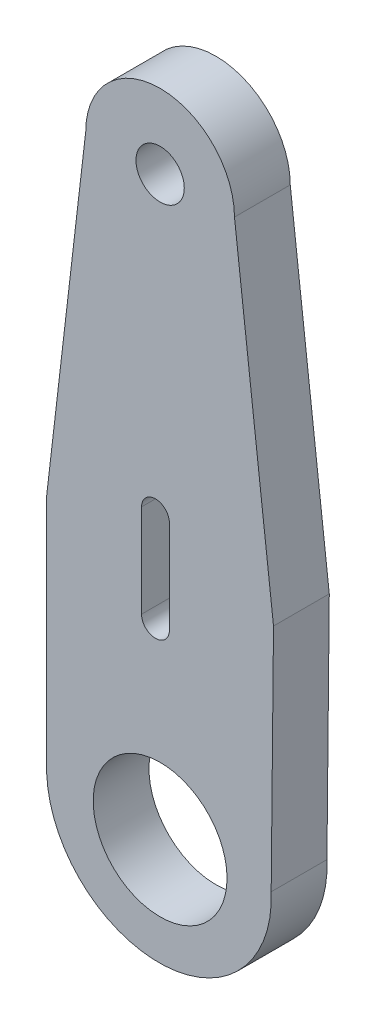
ISO-10303-21;
HEADER;
FILE_DESCRIPTION(('STEP AP214'),'2;1');
FILE_NAME('part.step','',(''),(''),'','','');
FILE_SCHEMA(('AUTOMOTIVE_DESIGN { 1 0 10303 214 1 1 1 1 }'));
ENDSEC;
DATA;
#1=APPLICATION_CONTEXT('core data for automotive mechanical design processes');
#2=APPLICATION_PROTOCOL_DEFINITION('international standard','automotive_design',2000,#1);
#3=PRODUCT_CONTEXT('',#1,'mechanical');
#4=PRODUCT('Part','Part','',(#3));
#5=PRODUCT_RELATED_PRODUCT_CATEGORY('part','',(#4));
#6=PRODUCT_DEFINITION_FORMATION('','',#4);
#7=PRODUCT_DEFINITION_CONTEXT('part definition',#1,'design');
#8=PRODUCT_DEFINITION('design','',#6,#7);
#9=PRODUCT_DEFINITION_SHAPE('','',#8);
#10=(LENGTH_UNIT() NAMED_UNIT(*) SI_UNIT(.MILLI.,.METRE.));
#11=(NAMED_UNIT(*) PLANE_ANGLE_UNIT() SI_UNIT($,.RADIAN.));
#12=(NAMED_UNIT(*) SI_UNIT($,.STERADIAN.) SOLID_ANGLE_UNIT());
#13=UNCERTAINTY_MEASURE_WITH_UNIT(LENGTH_MEASURE(1.E-05),#10,'distance_accuracy_value','');
#14=(GEOMETRIC_REPRESENTATION_CONTEXT(3) GLOBAL_UNCERTAINTY_ASSIGNED_CONTEXT((#13)) GLOBAL_UNIT_ASSIGNED_CONTEXT((#10,
#11,#12)) REPRESENTATION_CONTEXT('',''));
#15=CARTESIAN_POINT('',(0.,0.,0.));
#16=DIRECTION('',(0.,0.,1.));
#17=DIRECTION('',(1.,0.,0.));
#18=AXIS2_PLACEMENT_3D('',#15,#16,#17);
#19=CARTESIAN_POINT('',(60.5000000000001,56.3248766172572,3.));
#20=DIRECTION('',(0.,0.,1.));
#21=DIRECTION('',(1.,0.,0.));
#22=AXIS2_PLACEMENT_3D('',#19,#20,#21);
#23=PLANE('',#22);
#24=CARTESIAN_POINT('',(60.5000000000001,56.3248766172572,3.));
#25=DIRECTION('',(0.,0.,1.));
#26=DIRECTION('',(1.,0.,0.));
#27=AXIS2_PLACEMENT_3D('',#24,#25,#26);
#28=CIRCLE('',#27,1.3);
#29=CARTESIAN_POINT('',(61.8000000000001,56.3248766172572,3.));
#30=VERTEX_POINT('',#29);
#31=EDGE_CURVE('E154',#30,#30,#28,.T.);
#32=ORIENTED_EDGE('',*,*,#31,.F.);
#33=EDGE_LOOP('',(#32));
#34=FACE_BOUND('',#33,.T.);
#35=CARTESIAN_POINT('',(60.5000000000001,56.3248766172572,3.));
#36=DIRECTION('',(0.,0.,1.));
#37=DIRECTION('',(1.,0.,0.));
#38=AXIS2_PLACEMENT_3D('',#35,#36,#37);
#39=CIRCLE('',#38,4.00000000000051);
#40=CARTESIAN_POINT('',(64.5000000000006,56.324876617257,3.));
#41=VERTEX_POINT('',#40);
#42=CARTESIAN_POINT('',(56.4999999999995,56.3248766172572,3.));
#43=VERTEX_POINT('',#42);
#44=EDGE_CURVE('E160',#41,#43,#39,.T.);
#45=ORIENTED_EDGE('',*,*,#44,.T.);
#46=DIRECTION('',(-0.115881324440659,-0.993263066184321,0.));
#47=VECTOR('',#46,1.);
#48=CARTESIAN_POINT('',(56.4999999999995,56.3248766172572,3.));
#49=LINE('',#48,#47);
#50=CARTESIAN_POINT('',(54.4000000000001,38.3249750019231,3.));
#51=VERTEX_POINT('',#50);
#52=EDGE_CURVE('E163',#43,#51,#49,.T.);
#53=ORIENTED_EDGE('',*,*,#52,.T.);
#54=DIRECTION('',(0.,-1.,0.));
#55=VECTOR('',#54,1.);
#56=CARTESIAN_POINT('',(54.4000000000001,32.3249750019231,3.));
#57=LINE('',#56,#55);
#58=CARTESIAN_POINT('',(54.4000000000001,25.3249750019231,3.));
#59=VERTEX_POINT('',#58);
#60=EDGE_CURVE('E166',#51,#59,#57,.T.);
#61=ORIENTED_EDGE('',*,*,#60,.T.);
#62=CARTESIAN_POINT('',(60.4371809123243,25.6020561095563,3.));
#63=DIRECTION('',(0.,0.,1.));
#64=DIRECTION('',(1.,0.,0.));
#65=AXIS2_PLACEMENT_3D('',#62,#63,#64);
#66=CIRCLE('',#65,6.0435359937986);
#67=CARTESIAN_POINT('',(66.4743618246486,25.8791372171896,3.));
#68=VERTEX_POINT('',#67);
#69=EDGE_CURVE('E168',#59,#68,#66,.T.);
#70=ORIENTED_EDGE('',*,*,#69,.T.);
#71=DIRECTION('',(0.0100942802278319,0.999949051455464,0.));
#72=VECTOR('',#71,1.);
#73=CARTESIAN_POINT('',(66.6,38.3249750019231,3.));
#74=LINE('',#73,#72);
#75=CARTESIAN_POINT('',(66.6,38.3249750019231,3.));
#76=VERTEX_POINT('',#75);
#77=EDGE_CURVE('E170',#68,#76,#74,.T.);
#78=ORIENTED_EDGE('',*,*,#77,.T.);
#79=DIRECTION('',(-0.11588132444066,0.993263066184321,0.));
#80=VECTOR('',#79,1.);
#81=CARTESIAN_POINT('',(64.5000000000006,56.324876617257,3.));
#82=LINE('',#81,#80);
#83=EDGE_CURVE('E172',#76,#41,#82,.T.);
#84=ORIENTED_EDGE('',*,*,#83,.T.);
#85=EDGE_LOOP('',(#45,#53,#61,#70,#78,#84));
#86=FACE_BOUND('',#85,.T.);
#87=CARTESIAN_POINT('',(60.5000500000001,25.3249847224198,3.));
#88=DIRECTION('',(0.,0.,1.));
#89=DIRECTION('',(1.,0.,0.));
#90=AXIS2_PLACEMENT_3D('',#87,#88,#89);
#91=CIRCLE('',#90,3.6);
#92=CARTESIAN_POINT('',(64.1000500000001,25.3249847224198,3.));
#93=VERTEX_POINT('',#92);
#94=EDGE_CURVE('E148',#93,#93,#91,.T.);
#95=ORIENTED_EDGE('',*,*,#94,.F.);
#96=EDGE_LOOP('',(#95));
#97=FACE_BOUND('',#96,.T.);
#98=DIRECTION('',(0.,-1.,0.));
#99=VECTOR('',#98,1.);
#100=CARTESIAN_POINT('',(59.5000000000003,35.32493472242,3.));
#101=LINE('',#100,#99);
#102=CARTESIAN_POINT('',(59.5000000000005,40.3249347224198,3.));
#103=VERTEX_POINT('',#102);
#104=CARTESIAN_POINT('',(59.5000000000003,35.32493472242,3.));
#105=VERTEX_POINT('',#104);
#106=EDGE_CURVE('E120',#103,#105,#101,.T.);
#107=ORIENTED_EDGE('',*,*,#106,.F.);
#108=CARTESIAN_POINT('',(60.2500000000003,40.3249347224198,3.));
#109=DIRECTION('',(0.,0.,1.));
#110=DIRECTION('',(-1.,0.,0.));
#111=AXIS2_PLACEMENT_3D('',#108,#109,#110);
#112=CIRCLE('',#111,0.749999999999886);
#113=CARTESIAN_POINT('',(61.0000000000003,40.3249347224198,3.));
#114=VERTEX_POINT('',#113);
#115=EDGE_CURVE('E112',#114,#103,#112,.T.);
#116=ORIENTED_EDGE('',*,*,#115,.F.);
#117=DIRECTION('',(0.,1.,0.));
#118=VECTOR('',#117,1.);
#119=CARTESIAN_POINT('',(61.0000000000003,40.3249347224198,3.));
#120=LINE('',#119,#118);
#121=CARTESIAN_POINT('',(61.0000000000003,35.32493472242,3.));
#122=VERTEX_POINT('',#121);
#123=EDGE_CURVE('E134',#122,#114,#120,.T.);
#124=ORIENTED_EDGE('',*,*,#123,.F.);
#125=CARTESIAN_POINT('',(60.2500000000003,35.32493472242,3.));
#126=DIRECTION('',(0.,0.,1.));
#127=DIRECTION('',(1.,0.,0.));
#128=AXIS2_PLACEMENT_3D('',#125,#126,#127);
#129=CIRCLE('',#128,0.750000000000001);
#130=EDGE_CURVE('E132',#105,#122,#129,.T.);
#131=ORIENTED_EDGE('',*,*,#130,.F.);
#132=EDGE_LOOP('',(#107,#116,#124,#131));
#133=FACE_BOUND('',#132,.T.);
#134=ADVANCED_FACE('F35',(#34,#86,#97,#133),#23,.T.);
#135=CARTESIAN_POINT('',(60.5000000000001,56.3248766172572,0.));
#136=DIRECTION('',(0.,0.,1.));
#137=DIRECTION('',(1.,0.,0.));
#138=AXIS2_PLACEMENT_3D('',#135,#136,#137);
#139=PLANE('',#138);
#140=CARTESIAN_POINT('',(60.5000500000001,25.3249847224198,0.));
#141=DIRECTION('',(0.,0.,1.));
#142=DIRECTION('',(1.,0.,0.));
#143=AXIS2_PLACEMENT_3D('',#140,#141,#142);
#144=CIRCLE('',#143,3.6);
#145=CARTESIAN_POINT('',(64.1000500000001,25.3249847224198,0.));
#146=VERTEX_POINT('',#145);
#147=EDGE_CURVE('E128',#146,#146,#144,.T.);
#148=ORIENTED_EDGE('',*,*,#147,.T.);
#149=EDGE_LOOP('',(#148));
#150=FACE_BOUND('',#149,.T.);
#151=CARTESIAN_POINT('',(60.5000000000001,56.3248766172572,0.));
#152=DIRECTION('',(0.,0.,1.));
#153=DIRECTION('',(1.,0.,0.));
#154=AXIS2_PLACEMENT_3D('',#151,#152,#153);
#155=CIRCLE('',#154,1.3);
#156=CARTESIAN_POINT('',(61.8000000000001,56.3248766172572,0.));
#157=VERTEX_POINT('',#156);
#158=EDGE_CURVE('E151',#157,#157,#155,.T.);
#159=ORIENTED_EDGE('',*,*,#158,.T.);
#160=EDGE_LOOP('',(#159));
#161=FACE_BOUND('',#160,.T.);
#162=CARTESIAN_POINT('',(60.5000000000001,56.3248766172572,0.));
#163=DIRECTION('',(0.,0.,1.));
#164=DIRECTION('',(1.,0.,0.));
#165=AXIS2_PLACEMENT_3D('',#162,#163,#164);
#166=CIRCLE('',#165,4.00000000000051);
#167=CARTESIAN_POINT('',(64.5000000000006,56.324876617257,0.));
#168=VERTEX_POINT('',#167);
#169=CARTESIAN_POINT('',(56.4999999999995,56.3248766172572,0.));
#170=VERTEX_POINT('',#169);
#171=EDGE_CURVE('E157',#168,#170,#166,.T.);
#172=ORIENTED_EDGE('',*,*,#171,.F.);
#173=DIRECTION('',(-0.11588132444066,0.993263066184321,0.));
#174=VECTOR('',#173,1.);
#175=CARTESIAN_POINT('',(64.5000000000006,56.324876617257,0.));
#176=LINE('',#175,#174);
#177=CARTESIAN_POINT('',(66.6,38.3249750019231,0.));
#178=VERTEX_POINT('',#177);
#179=EDGE_CURVE('E164',#178,#168,#176,.T.);
#180=ORIENTED_EDGE('',*,*,#179,.F.);
#181=DIRECTION('',(0.0100942802278319,0.999949051455464,0.));
#182=VECTOR('',#181,1.);
#183=CARTESIAN_POINT('',(66.6,38.3249750019231,0.));
#184=LINE('',#183,#182);
#185=CARTESIAN_POINT('',(66.4743618246486,25.8791372171896,0.));
#186=VERTEX_POINT('',#185);
#187=EDGE_CURVE('E184',#186,#178,#184,.T.);
#188=ORIENTED_EDGE('',*,*,#187,.F.);
#189=CARTESIAN_POINT('',(60.4371809123243,25.6020561095563,0.));
#190=DIRECTION('',(0.,0.,1.));
#191=DIRECTION('',(1.,0.,0.));
#192=AXIS2_PLACEMENT_3D('',#189,#190,#191);
#193=CIRCLE('',#192,6.0435359937986);
#194=CARTESIAN_POINT('',(54.4000000000001,25.3249750019231,0.));
#195=VERTEX_POINT('',#194);
#196=EDGE_CURVE('E182',#195,#186,#193,.T.);
#197=ORIENTED_EDGE('',*,*,#196,.F.);
#198=DIRECTION('',(0.,-1.,0.));
#199=VECTOR('',#198,1.);
#200=CARTESIAN_POINT('',(54.4000000000001,32.3249750019231,0.));
#201=LINE('',#200,#199);
#202=CARTESIAN_POINT('',(54.4000000000001,38.3249750019231,0.));
#203=VERTEX_POINT('',#202);
#204=EDGE_CURVE('E180',#203,#195,#201,.T.);
#205=ORIENTED_EDGE('',*,*,#204,.F.);
#206=DIRECTION('',(-0.115881324440659,-0.993263066184321,0.));
#207=VECTOR('',#206,1.);
#208=CARTESIAN_POINT('',(56.4999999999995,56.3248766172572,0.));
#209=LINE('',#208,#207);
#210=EDGE_CURVE('E177',#170,#203,#209,.T.);
#211=ORIENTED_EDGE('',*,*,#210,.F.);
#212=EDGE_LOOP('',(#172,#180,#188,#197,#205,#211));
#213=FACE_BOUND('',#212,.T.);
#214=CARTESIAN_POINT('',(60.2500000000003,40.3249347224198,0.));
#215=DIRECTION('',(0.,0.,1.));
#216=DIRECTION('',(-1.,0.,0.));
#217=AXIS2_PLACEMENT_3D('',#214,#215,#216);
#218=CIRCLE('',#217,0.749999999999886);
#219=CARTESIAN_POINT('',(61.0000000000003,40.3249347224198,0.));
#220=VERTEX_POINT('',#219);
#221=CARTESIAN_POINT('',(59.5000000000005,40.3249347224198,0.));
#222=VERTEX_POINT('',#221);
#223=EDGE_CURVE('E58',#220,#222,#218,.T.);
#224=ORIENTED_EDGE('',*,*,#223,.T.);
#225=DIRECTION('',(0.,-1.,0.));
#226=VECTOR('',#225,1.);
#227=CARTESIAN_POINT('',(59.5000000000003,35.32493472242,0.));
#228=LINE('',#227,#226);
#229=CARTESIAN_POINT('',(59.5000000000003,35.32493472242,0.));
#230=VERTEX_POINT('',#229);
#231=EDGE_CURVE('E127',#222,#230,#228,.T.);
#232=ORIENTED_EDGE('',*,*,#231,.T.);
#233=CARTESIAN_POINT('',(60.2500000000003,35.32493472242,0.));
#234=DIRECTION('',(0.,0.,1.));
#235=DIRECTION('',(1.,0.,0.));
#236=AXIS2_PLACEMENT_3D('',#233,#234,#235);
#237=CIRCLE('',#236,0.750000000000001);
#238=CARTESIAN_POINT('',(61.0000000000003,35.32493472242,0.));
#239=VERTEX_POINT('',#238);
#240=EDGE_CURVE('E140',#230,#239,#237,.T.);
#241=ORIENTED_EDGE('',*,*,#240,.T.);
#242=DIRECTION('',(0.,1.,0.));
#243=VECTOR('',#242,1.);
#244=CARTESIAN_POINT('',(61.0000000000003,40.3249347224198,0.));
#245=LINE('',#244,#243);
#246=EDGE_CURVE('E121',#239,#220,#245,.T.);
#247=ORIENTED_EDGE('',*,*,#246,.T.);
#248=EDGE_LOOP('',(#224,#232,#241,#247));
#249=FACE_BOUND('',#248,.T.);
#250=ADVANCED_FACE('F208',(#150,#161,#213,#249),#139,.F.);
#251=CARTESIAN_POINT('',(60.5000000000001,56.3248766172572,3.));
#252=DIRECTION('',(0.,0.,-1.));
#253=DIRECTION('',(-1.,0.,0.));
#254=AXIS2_PLACEMENT_3D('',#251,#252,#253);
#255=CYLINDRICAL_SURFACE('',#254,4.00000000000051);
#256=ORIENTED_EDGE('',*,*,#171,.T.);
#257=DIRECTION('',(0.,0.,-1.));
#258=VECTOR('',#257,1.);
#259=CARTESIAN_POINT('',(56.4999999999995,56.3248766172572,3.));
#260=LINE('',#259,#258);
#261=EDGE_CURVE('E11',#43,#170,#260,.T.);
#262=ORIENTED_EDGE('',*,*,#261,.F.);
#263=ORIENTED_EDGE('',*,*,#44,.F.);
#264=DIRECTION('',(0.,0.,-1.));
#265=VECTOR('',#264,1.);
#266=CARTESIAN_POINT('',(64.5000000000006,56.324876617257,3.));
#267=LINE('',#266,#265);
#268=EDGE_CURVE('E174',#41,#168,#267,.T.);
#269=ORIENTED_EDGE('',*,*,#268,.T.);
#270=EDGE_LOOP('',(#256,#262,#263,#269));
#271=FACE_BOUND('',#270,.T.);
#272=ADVANCED_FACE('F37',(#271),#255,.T.);
#273=CARTESIAN_POINT('',(56.4999999999995,56.3248766172572,3.));
#274=DIRECTION('',(0.993263066184321,-0.115881324440659,0.));
#275=DIRECTION('',(0.115881324440659,0.993263066184321,0.));
#276=AXIS2_PLACEMENT_3D('',#273,#274,#275);
#277=PLANE('',#276);
#278=ORIENTED_EDGE('',*,*,#210,.T.);
#279=DIRECTION('',(0.,0.,-1.));
#280=VECTOR('',#279,1.);
#281=CARTESIAN_POINT('',(54.4000000000001,38.3249750019231,3.));
#282=LINE('',#281,#280);
#283=EDGE_CURVE('E43',#51,#203,#282,.T.);
#284=ORIENTED_EDGE('',*,*,#283,.F.);
#285=ORIENTED_EDGE('',*,*,#52,.F.);
#286=ORIENTED_EDGE('',*,*,#261,.T.);
#287=EDGE_LOOP('',(#278,#284,#285,#286));
#288=FACE_BOUND('',#287,.T.);
#289=ADVANCED_FACE('F204',(#288),#277,.F.);
#290=CARTESIAN_POINT('',(54.4000000000001,32.3249750019231,3.));
#291=DIRECTION('',(1.,0.,0.));
#292=DIRECTION('',(0.,0.,-1.));
#293=AXIS2_PLACEMENT_3D('',#290,#291,#292);
#294=PLANE('',#293);
#295=ORIENTED_EDGE('',*,*,#204,.T.);
#296=DIRECTION('',(0.,0.,-1.));
#297=VECTOR('',#296,1.);
#298=CARTESIAN_POINT('',(54.4000000000001,25.3249750019231,3.));
#299=LINE('',#298,#297);
#300=EDGE_CURVE('E195',#59,#195,#299,.T.);
#301=ORIENTED_EDGE('',*,*,#300,.F.);
#302=ORIENTED_EDGE('',*,*,#60,.F.);
#303=ORIENTED_EDGE('',*,*,#283,.T.);
#304=EDGE_LOOP('',(#295,#301,#302,#303));
#305=FACE_BOUND('',#304,.T.);
#306=ADVANCED_FACE('F201',(#305),#294,.F.);
#307=CARTESIAN_POINT('',(60.4371809123243,25.6020561095563,3.));
#308=DIRECTION('',(0.,0.,-1.));
#309=DIRECTION('',(-1.,0.,0.));
#310=AXIS2_PLACEMENT_3D('',#307,#308,#309);
#311=CYLINDRICAL_SURFACE('',#310,6.0435359937986);
#312=ORIENTED_EDGE('',*,*,#196,.T.);
#313=DIRECTION('',(0.,0.,-1.));
#314=VECTOR('',#313,1.);
#315=CARTESIAN_POINT('',(66.4743618246486,25.8791372171896,3.));
#316=LINE('',#315,#314);
#317=EDGE_CURVE('E192',#68,#186,#316,.T.);
#318=ORIENTED_EDGE('',*,*,#317,.F.);
#319=ORIENTED_EDGE('',*,*,#69,.F.);
#320=ORIENTED_EDGE('',*,*,#300,.T.);
#321=EDGE_LOOP('',(#312,#318,#319,#320));
#322=FACE_BOUND('',#321,.T.);
#323=ADVANCED_FACE('F215',(#322),#311,.T.);
#324=CARTESIAN_POINT('',(66.6,38.3249750019231,3.));
#325=DIRECTION('',(-0.999949051455464,0.0100942802278319,0.));
#326=DIRECTION('',(-0.0100942802278319,-0.999949051455464,0.));
#327=AXIS2_PLACEMENT_3D('',#324,#325,#326);
#328=PLANE('',#327);
#329=ORIENTED_EDGE('',*,*,#187,.T.);
#330=DIRECTION('',(0.,0.,-1.));
#331=VECTOR('',#330,1.);
#332=CARTESIAN_POINT('',(66.6,38.3249750019231,3.));
#333=LINE('',#332,#331);
#334=EDGE_CURVE('E189',#76,#178,#333,.T.);
#335=ORIENTED_EDGE('',*,*,#334,.F.);
#336=ORIENTED_EDGE('',*,*,#77,.F.);
#337=ORIENTED_EDGE('',*,*,#317,.T.);
#338=EDGE_LOOP('',(#329,#335,#336,#337));
#339=FACE_BOUND('',#338,.T.);
#340=ADVANCED_FACE('F219',(#339),#328,.F.);
#341=CARTESIAN_POINT('',(64.5000000000006,56.324876617257,3.));
#342=DIRECTION('',(-0.993263066184321,-0.11588132444066,0.));
#343=DIRECTION('',(0.11588132444066,-0.993263066184321,0.));
#344=AXIS2_PLACEMENT_3D('',#341,#342,#343);
#345=PLANE('',#344);
#346=ORIENTED_EDGE('',*,*,#179,.T.);
#347=ORIENTED_EDGE('',*,*,#268,.F.);
#348=ORIENTED_EDGE('',*,*,#83,.F.);
#349=ORIENTED_EDGE('',*,*,#334,.T.);
#350=EDGE_LOOP('',(#346,#347,#348,#349));
#351=FACE_BOUND('',#350,.T.);
#352=ADVANCED_FACE('F228',(#351),#345,.F.);
#353=CARTESIAN_POINT('',(60.5000000000001,56.3248766172572,3.));
#354=DIRECTION('',(0.,0.,-1.));
#355=DIRECTION('',(-1.,0.,0.));
#356=AXIS2_PLACEMENT_3D('',#353,#354,#355);
#357=CYLINDRICAL_SURFACE('',#356,1.3);
#358=ORIENTED_EDGE('',*,*,#31,.T.);
#359=EDGE_LOOP('',(#358));
#360=FACE_BOUND('',#359,.T.);
#361=ORIENTED_EDGE('',*,*,#158,.F.);
#362=EDGE_LOOP('',(#361));
#363=FACE_BOUND('',#362,.T.);
#364=ADVANCED_FACE('F230',(#360,#363),#357,.F.);
#365=CARTESIAN_POINT('',(60.5000500000001,25.3249847224198,3.));
#366=DIRECTION('',(0.,0.,-1.));
#367=DIRECTION('',(-1.,0.,0.));
#368=AXIS2_PLACEMENT_3D('',#365,#366,#367);
#369=CYLINDRICAL_SURFACE('',#368,3.6);
#370=ORIENTED_EDGE('',*,*,#94,.T.);
#371=EDGE_LOOP('',(#370));
#372=FACE_BOUND('',#371,.T.);
#373=ORIENTED_EDGE('',*,*,#147,.F.);
#374=EDGE_LOOP('',(#373));
#375=FACE_BOUND('',#374,.T.);
#376=ADVANCED_FACE('F236',(#372,#375),#369,.F.);
#377=CARTESIAN_POINT('',(60.2500000000003,40.3249347224198,3.));
#378=DIRECTION('',(0.,0.,-1.));
#379=DIRECTION('',(-1.,0.,0.));
#380=AXIS2_PLACEMENT_3D('',#377,#378,#379);
#381=CYLINDRICAL_SURFACE('',#380,0.749999999999886);
#382=ORIENTED_EDGE('',*,*,#223,.F.);
#383=DIRECTION('',(0.,0.,-1.));
#384=VECTOR('',#383,1.);
#385=CARTESIAN_POINT('',(61.0000000000003,40.3249347224198,3.));
#386=LINE('',#385,#384);
#387=EDGE_CURVE('E116',#114,#220,#386,.T.);
#388=ORIENTED_EDGE('',*,*,#387,.F.);
#389=ORIENTED_EDGE('',*,*,#115,.T.);
#390=DIRECTION('',(0.,0.,-1.));
#391=VECTOR('',#390,1.);
#392=CARTESIAN_POINT('',(59.5000000000005,40.3249347224198,3.));
#393=LINE('',#392,#391);
#394=EDGE_CURVE('E115',#103,#222,#393,.T.);
#395=ORIENTED_EDGE('',*,*,#394,.T.);
#396=EDGE_LOOP('',(#382,#388,#389,#395));
#397=FACE_BOUND('',#396,.T.);
#398=ADVANCED_FACE('F114',(#397),#381,.F.);
#399=CARTESIAN_POINT('',(59.5000000000003,35.32493472242,3.));
#400=DIRECTION('',(1.,0.,0.));
#401=DIRECTION('',(0.,1.,0.));
#402=AXIS2_PLACEMENT_3D('',#399,#400,#401);
#403=PLANE('',#402);
#404=ORIENTED_EDGE('',*,*,#231,.F.);
#405=ORIENTED_EDGE('',*,*,#394,.F.);
#406=ORIENTED_EDGE('',*,*,#106,.T.);
#407=DIRECTION('',(0.,0.,-1.));
#408=VECTOR('',#407,1.);
#409=CARTESIAN_POINT('',(59.5000000000003,35.32493472242,3.));
#410=LINE('',#409,#408);
#411=EDGE_CURVE('E129',#105,#230,#410,.T.);
#412=ORIENTED_EDGE('',*,*,#411,.T.);
#413=EDGE_LOOP('',(#404,#405,#406,#412));
#414=FACE_BOUND('',#413,.T.);
#415=ADVANCED_FACE('F124',(#414),#403,.T.);
#416=CARTESIAN_POINT('',(60.2500000000003,35.32493472242,3.));
#417=DIRECTION('',(0.,0.,-1.));
#418=DIRECTION('',(-1.,0.,0.));
#419=AXIS2_PLACEMENT_3D('',#416,#417,#418);
#420=CYLINDRICAL_SURFACE('',#419,0.750000000000001);
#421=ORIENTED_EDGE('',*,*,#240,.F.);
#422=ORIENTED_EDGE('',*,*,#411,.F.);
#423=ORIENTED_EDGE('',*,*,#130,.T.);
#424=DIRECTION('',(0.,0.,-1.));
#425=VECTOR('',#424,1.);
#426=CARTESIAN_POINT('',(61.0000000000003,35.32493472242,3.));
#427=LINE('',#426,#425);
#428=EDGE_CURVE('E50',#122,#239,#427,.T.);
#429=ORIENTED_EDGE('',*,*,#428,.T.);
#430=EDGE_LOOP('',(#421,#422,#423,#429));
#431=FACE_BOUND('',#430,.T.);
#432=ADVANCED_FACE('F257',(#431),#420,.F.);
#433=CARTESIAN_POINT('',(61.0000000000003,40.3249347224198,3.));
#434=DIRECTION('',(-1.,0.,0.));
#435=DIRECTION('',(0.,-1.,0.));
#436=AXIS2_PLACEMENT_3D('',#433,#434,#435);
#437=PLANE('',#436);
#438=ORIENTED_EDGE('',*,*,#246,.F.);
#439=ORIENTED_EDGE('',*,*,#428,.F.);
#440=ORIENTED_EDGE('',*,*,#123,.T.);
#441=ORIENTED_EDGE('',*,*,#387,.T.);
#442=EDGE_LOOP('',(#438,#439,#440,#441));
#443=FACE_BOUND('',#442,.T.);
#444=ADVANCED_FACE('F260',(#443),#437,.T.);
#445=CLOSED_SHELL('',(#134,#250,#272,#289,#306,#323,#340,#352,#364,#376,#398,#415,#432,#444));
#446=MANIFOLD_SOLID_BREP('B2',#445);
#447=ADVANCED_BREP_SHAPE_REPRESENTATION('',(#18,#446),#14);
#448=SHAPE_DEFINITION_REPRESENTATION(#9,#447);
ENDSEC;
END-ISO-10303-21;
